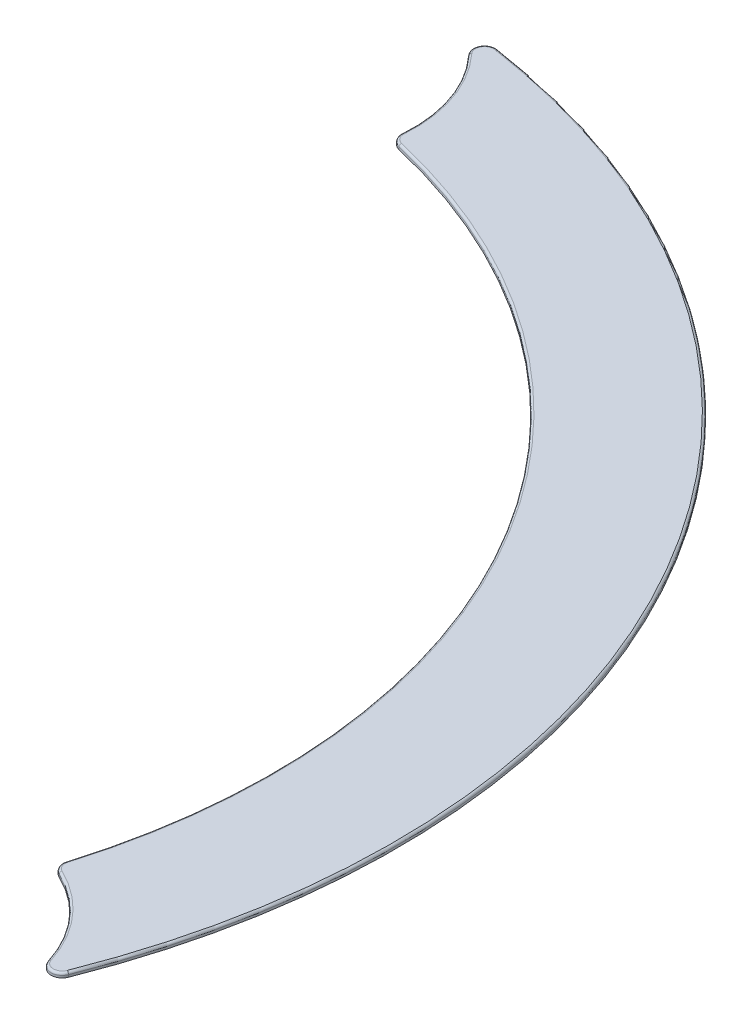
ISO-10303-21;
HEADER;
FILE_DESCRIPTION(('STEP AP214'),'2;1');
FILE_NAME('part.step','',(''),(''),'','','');
FILE_SCHEMA(('AUTOMOTIVE_DESIGN { 1 0 10303 214 1 1 1 1 }'));
ENDSEC;
DATA;
#1=APPLICATION_CONTEXT('core data for automotive mechanical design processes');
#2=APPLICATION_PROTOCOL_DEFINITION('international standard','automotive_design',2000,#1);
#3=PRODUCT_CONTEXT('',#1,'mechanical');
#4=PRODUCT('Part','Part','',(#3));
#5=PRODUCT_RELATED_PRODUCT_CATEGORY('part','',(#4));
#6=PRODUCT_DEFINITION_FORMATION('','',#4);
#7=PRODUCT_DEFINITION_CONTEXT('part definition',#1,'design');
#8=PRODUCT_DEFINITION('design','',#6,#7);
#9=PRODUCT_DEFINITION_SHAPE('','',#8);
#10=(LENGTH_UNIT() NAMED_UNIT(*) SI_UNIT(.MILLI.,.METRE.));
#11=(NAMED_UNIT(*) PLANE_ANGLE_UNIT() SI_UNIT($,.RADIAN.));
#12=(NAMED_UNIT(*) SI_UNIT($,.STERADIAN.) SOLID_ANGLE_UNIT());
#13=UNCERTAINTY_MEASURE_WITH_UNIT(LENGTH_MEASURE(1.E-05),#10,'distance_accuracy_value','');
#14=(GEOMETRIC_REPRESENTATION_CONTEXT(3) GLOBAL_UNCERTAINTY_ASSIGNED_CONTEXT((#13)) GLOBAL_UNIT_ASSIGNED_CONTEXT((#10,
#11,#12)) REPRESENTATION_CONTEXT('',''));
#15=CARTESIAN_POINT('',(0.,0.,0.));
#16=DIRECTION('',(0.,0.,1.));
#17=DIRECTION('',(1.,0.,0.));
#18=AXIS2_PLACEMENT_3D('',#15,#16,#17);
#19=CARTESIAN_POINT('',(0.,0.2,0.));
#20=DIRECTION('',(0.,-1.,0.));
#21=DIRECTION('',(0.,0.,-1.));
#22=AXIS2_PLACEMENT_3D('',#19,#20,#21);
#23=CYLINDRICAL_SURFACE('',#22,27.75);
#24=DIRECTION('',(0.,-1.,0.));
#25=VECTOR('',#24,1.);
#26=CARTESIAN_POINT('',(26.5742248571388,0.2,7.99206314053046));
#27=LINE('',#26,#25);
#28=CARTESIAN_POINT('',(26.5742248571388,0.,7.99206314053046));
#29=VERTEX_POINT('',#28);
#30=CARTESIAN_POINT('',(26.5742248571388,0.1,7.99206314053046));
#31=VERTEX_POINT('',#30);
#32=EDGE_CURVE('E161',#29,#31,#27,.F.);
#33=ORIENTED_EDGE('',*,*,#32,.T.);
#34=CARTESIAN_POINT('',(0.,0.1,0.));
#35=DIRECTION('',(0.,-1.,0.));
#36=DIRECTION('',(0.,0.,-1.));
#37=AXIS2_PLACEMENT_3D('',#34,#35,#36);
#38=CIRCLE('',#37,27.75);
#39=CARTESIAN_POINT('',(6.36578272022092,0.1,-27.0099853824273));
#40=VERTEX_POINT('',#39);
#41=EDGE_CURVE('E55',#31,#40,#38,.F.);
#42=ORIENTED_EDGE('',*,*,#41,.T.);
#43=DIRECTION('',(0.,-1.,0.));
#44=VECTOR('',#43,1.);
#45=CARTESIAN_POINT('',(6.36578272022092,0.2,-27.0099853824273));
#46=LINE('',#45,#44);
#47=CARTESIAN_POINT('',(6.36578272022092,0.,-27.0099853824273));
#48=VERTEX_POINT('',#47);
#49=EDGE_CURVE('E163',#40,#48,#46,.T.);
#50=ORIENTED_EDGE('',*,*,#49,.T.);
#51=CARTESIAN_POINT('',(0.,0.,0.));
#52=DIRECTION('',(0.,-1.,0.));
#53=DIRECTION('',(0.,0.,-1.));
#54=AXIS2_PLACEMENT_3D('',#51,#52,#53);
#55=CIRCLE('',#54,27.75);
#56=EDGE_CURVE('E220',#48,#29,#55,.T.);
#57=ORIENTED_EDGE('',*,*,#56,.T.);
#58=EDGE_LOOP('',(#33,#42,#50,#57));
#59=FACE_BOUND('',#58,.T.);
#60=ADVANCED_FACE('F31',(#59),#23,.F.);
#61=CARTESIAN_POINT('',(24.2487113059642,0.2,14.0000000000001));
#62=DIRECTION('',(0.,-1.,0.));
#63=DIRECTION('',(0.,0.,-1.));
#64=AXIS2_PLACEMENT_3D('',#61,#62,#63);
#65=CYLINDRICAL_SURFACE('',#64,6.);
#66=DIRECTION('',(0.,-1.,0.));
#67=VECTOR('',#66,1.);
#68=CARTESIAN_POINT('',(29.9736820208757,0.2,12.2042521576219));
#69=LINE('',#68,#67);
#70=CARTESIAN_POINT('',(29.9736820208757,0.,12.2042521576219));
#71=VERTEX_POINT('',#70);
#72=CARTESIAN_POINT('',(29.9736820208757,0.1,12.2042521576219));
#73=VERTEX_POINT('',#72);
#74=EDGE_CURVE('E165',#71,#73,#69,.F.);
#75=ORIENTED_EDGE('',*,*,#74,.T.);
#76=CARTESIAN_POINT('',(24.2487113059642,0.1,14.0000000000001));
#77=DIRECTION('',(0.,-1.,0.));
#78=DIRECTION('',(0.,0.,-1.));
#79=AXIS2_PLACEMENT_3D('',#76,#77,#78);
#80=CIRCLE('',#79,6.);
#81=CARTESIAN_POINT('',(26.837322149163,0.1,8.58713625679787));
#82=VERTEX_POINT('',#81);
#83=EDGE_CURVE('E193',#73,#82,#80,.F.);
#84=ORIENTED_EDGE('',*,*,#83,.T.);
#85=DIRECTION('',(0.,-1.,0.));
#86=VECTOR('',#85,1.);
#87=CARTESIAN_POINT('',(26.837322149163,0.2,8.58713625679787));
#88=LINE('',#87,#86);
#89=CARTESIAN_POINT('',(26.837322149163,0.,8.58713625679787));
#90=VERTEX_POINT('',#89);
#91=EDGE_CURVE('E168',#82,#90,#88,.T.);
#92=ORIENTED_EDGE('',*,*,#91,.T.);
#93=CARTESIAN_POINT('',(24.2487113059642,0.,14.0000000000001));
#94=DIRECTION('',(0.,-1.,0.));
#95=DIRECTION('',(0.,0.,1.));
#96=AXIS2_PLACEMENT_3D('',#93,#94,#95);
#97=CIRCLE('',#96,6.);
#98=EDGE_CURVE('E151',#90,#71,#97,.T.);
#99=ORIENTED_EDGE('',*,*,#98,.T.);
#100=EDGE_LOOP('',(#75,#84,#92,#99));
#101=FACE_BOUND('',#100,.T.);
#102=ADVANCED_FACE('F232',(#101),#65,.F.);
#103=CARTESIAN_POINT('',(0.,0.2,0.));
#104=DIRECTION('',(0.,-1.,0.));
#105=DIRECTION('',(0.,0.,-1.));
#106=AXIS2_PLACEMENT_3D('',#103,#104,#105);
#107=CYLINDRICAL_SURFACE('',#106,33.25);
#108=DIRECTION('',(0.,-1.,0.));
#109=VECTOR('',#108,1.);
#110=CARTESIAN_POINT('',(4.85885142671343,0.2,-32.8930701335878));
#111=LINE('',#110,#109);
#112=CARTESIAN_POINT('',(4.85885142671343,0.,-32.8930701335878));
#113=VERTEX_POINT('',#112);
#114=CARTESIAN_POINT('',(4.85885142671343,0.1,-32.8930701335878));
#115=VERTEX_POINT('',#114);
#116=EDGE_CURVE('E138',#113,#115,#111,.F.);
#117=ORIENTED_EDGE('',*,*,#116,.T.);
#118=CARTESIAN_POINT('',(0.,0.1,0.));
#119=DIRECTION('',(0.,-1.,0.));
#120=DIRECTION('',(0.,0.,-1.));
#121=AXIS2_PLACEMENT_3D('',#118,#119,#120);
#122=CIRCLE('',#121,33.25);
#123=CARTESIAN_POINT('',(30.9156600575069,0.1,12.2386462980459));
#124=VERTEX_POINT('',#123);
#125=EDGE_CURVE('E189',#115,#124,#122,.T.);
#126=ORIENTED_EDGE('',*,*,#125,.T.);
#127=DIRECTION('',(0.,-1.,0.));
#128=VECTOR('',#127,1.);
#129=CARTESIAN_POINT('',(30.9156600575069,0.2,12.2386462980459));
#130=LINE('',#129,#128);
#131=CARTESIAN_POINT('',(30.9156600575069,0.,12.2386462980459));
#132=VERTEX_POINT('',#131);
#133=EDGE_CURVE('E142',#124,#132,#130,.T.);
#134=ORIENTED_EDGE('',*,*,#133,.T.);
#135=CARTESIAN_POINT('',(0.,0.,0.));
#136=DIRECTION('',(0.,1.,0.));
#137=DIRECTION('',(0.,0.,1.));
#138=AXIS2_PLACEMENT_3D('',#135,#136,#137);
#139=CIRCLE('',#138,33.25);
#140=EDGE_CURVE('E148',#132,#113,#139,.T.);
#141=ORIENTED_EDGE('',*,*,#140,.T.);
#142=EDGE_LOOP('',(#117,#126,#134,#141));
#143=FACE_BOUND('',#142,.T.);
#144=ADVANCED_FACE('F272',(#143),#107,.T.);
#145=CARTESIAN_POINT('',(0.,0.2,-28.));
#146=DIRECTION('',(0.,-1.,0.));
#147=DIRECTION('',(0.,0.,-1.));
#148=AXIS2_PLACEMENT_3D('',#145,#146,#147);
#149=CYLINDRICAL_SURFACE('',#148,6.);
#150=DIRECTION('',(0.,-1.,0.));
#151=VECTOR('',#150,1.);
#152=CARTESIAN_POINT('',(5.98198293043628,0.2,-27.5353708791209));
#153=LINE('',#152,#151);
#154=CARTESIAN_POINT('',(5.98198293043628,0.,-27.5353708791209));
#155=VERTEX_POINT('',#154);
#156=CARTESIAN_POINT('',(5.98198293043628,0.1,-27.5353708791209));
#157=VERTEX_POINT('',#156);
#158=EDGE_CURVE('E132',#155,#157,#153,.F.);
#159=ORIENTED_EDGE('',*,*,#158,.T.);
#160=CARTESIAN_POINT('',(0.,0.1,-28.));
#161=DIRECTION('',(0.,-1.,0.));
#162=DIRECTION('',(0.,0.,-1.));
#163=AXIS2_PLACEMENT_3D('',#160,#161,#162);
#164=CIRCLE('',#163,6.);
#165=CARTESIAN_POINT('',(4.41764860774639,0.1,-32.0600961538462));
#166=VERTEX_POINT('',#165);
#167=EDGE_CURVE('E11',#157,#166,#164,.F.);
#168=ORIENTED_EDGE('',*,*,#167,.T.);
#169=DIRECTION('',(0.,-1.,0.));
#170=VECTOR('',#169,1.);
#171=CARTESIAN_POINT('',(4.41764860774639,0.2,-32.0600961538462));
#172=LINE('',#171,#170);
#173=CARTESIAN_POINT('',(4.41764860774639,0.,-32.0600961538462));
#174=VERTEX_POINT('',#173);
#175=EDGE_CURVE('E122',#166,#174,#172,.T.);
#176=ORIENTED_EDGE('',*,*,#175,.T.);
#177=CARTESIAN_POINT('',(0.,0.,-28.));
#178=DIRECTION('',(0.,-1.,0.));
#179=DIRECTION('',(0.,0.,1.));
#180=AXIS2_PLACEMENT_3D('',#177,#178,#179);
#181=CIRCLE('',#180,6.);
#182=EDGE_CURVE('E126',#174,#155,#181,.T.);
#183=ORIENTED_EDGE('',*,*,#182,.T.);
#184=EDGE_LOOP('',(#159,#168,#176,#183));
#185=FACE_BOUND('',#184,.T.);
#186=ADVANCED_FACE('F124',(#185),#149,.F.);
#187=CARTESIAN_POINT('',(12.1243556529821,0.2,7.00000000000006));
#188=DIRECTION('',(0.,-1.,0.));
#189=DIRECTION('',(0.,0.,-1.));
#190=AXIS2_PLACEMENT_3D('',#187,#188,#189);
#191=PLANE('',#190);
#192=CARTESIAN_POINT('',(0.,0.2,0.));
#193=DIRECTION('',(0.,-1.,0.));
#194=DIRECTION('',(0.,0.,-1.));
#195=AXIS2_PLACEMENT_3D('',#192,#193,#194);
#196=CIRCLE('',#195,33.15);
#197=CARTESIAN_POINT('',(30.8226806287625,0.2,12.2018383392548));
#198=VERTEX_POINT('',#197);
#199=CARTESIAN_POINT('',(4.84423833971579,0.2,-32.7941436068702));
#200=VERTEX_POINT('',#199);
#201=EDGE_CURVE('E182',#198,#200,#196,.F.);
#202=ORIENTED_EDGE('',*,*,#201,.T.);
#203=CARTESIAN_POINT('',(4.78578599172526,0.2,-32.3984375));
#204=DIRECTION('',(0.,-1.,0.));
#205=DIRECTION('',(0.,0.,-1.));
#206=AXIS2_PLACEMENT_3D('',#203,#204,#205);
#207=CIRCLE('',#206,0.4);
#208=CARTESIAN_POINT('',(4.49127608454216,0.2,-32.1277644230769));
#209=VERTEX_POINT('',#208);
#210=EDGE_CURVE('E184',#200,#209,#207,.F.);
#211=ORIENTED_EDGE('',*,*,#210,.T.);
#212=CARTESIAN_POINT('',(0.,0.2,-28.));
#213=DIRECTION('',(0.,-1.,0.));
#214=DIRECTION('',(0.,0.,-1.));
#215=AXIS2_PLACEMENT_3D('',#212,#213,#214);
#216=CIRCLE('',#215,6.1);
#217=CARTESIAN_POINT('',(6.08168264594355,0.2,-27.5276270604396));
#218=VERTEX_POINT('',#217);
#219=EDGE_CURVE('E170',#209,#218,#216,.T.);
#220=ORIENTED_EDGE('',*,*,#219,.T.);
#221=CARTESIAN_POINT('',(6.48048150797265,0.2,-27.4966517857143));
#222=DIRECTION('',(0.,-1.,0.));
#223=DIRECTION('',(0.,0.,-1.));
#224=AXIS2_PLACEMENT_3D('',#221,#222,#223);
#225=CIRCLE('',#224,0.4);
#226=CARTESIAN_POINT('',(6.38872247777127,0.2,-27.1073186630847));
#227=VERTEX_POINT('',#226);
#228=EDGE_CURVE('E172',#218,#227,#225,.F.);
#229=ORIENTED_EDGE('',*,*,#228,.T.);
#230=CARTESIAN_POINT('',(0.,0.2,0.));
#231=DIRECTION('',(0.,-1.,0.));
#232=DIRECTION('',(0.,0.,-1.));
#233=AXIS2_PLACEMENT_3D('',#230,#231,#232);
#234=CIRCLE('',#233,27.85);
#235=CARTESIAN_POINT('',(26.669987829597,0.2,8.0208633680639));
#236=VERTEX_POINT('',#235);
#237=EDGE_CURVE('E174',#227,#236,#234,.T.);
#238=ORIENTED_EDGE('',*,*,#237,.T.);
#239=CARTESIAN_POINT('',(27.0530397194296,0.2,8.13606427819768));
#240=DIRECTION('',(0.,-1.,0.));
#241=DIRECTION('',(0.,0.,-1.));
#242=AXIS2_PLACEMENT_3D('',#239,#240,#241);
#243=CIRCLE('',#242,0.4);
#244=CARTESIAN_POINT('',(26.8804656632164,0.2,8.49692186107783));
#245=VERTEX_POINT('',#244);
#246=EDGE_CURVE('E176',#236,#245,#243,.F.);
#247=ORIENTED_EDGE('',*,*,#246,.T.);
#248=CARTESIAN_POINT('',(24.2487113059642,0.2,14.0000000000001));
#249=DIRECTION('',(0.,-1.,0.));
#250=DIRECTION('',(0.,0.,-1.));
#251=AXIS2_PLACEMENT_3D('',#248,#249,#250);
#252=CIRCLE('',#251,6.1);
#253=CARTESIAN_POINT('',(30.0690981994575,0.2,12.1743230269156));
#254=VERTEX_POINT('',#253);
#255=EDGE_CURVE('E178',#245,#254,#252,.T.);
#256=ORIENTED_EDGE('',*,*,#255,.T.);
#257=CARTESIAN_POINT('',(30.450762913785,0.2,12.0546065040904));
#258=DIRECTION('',(0.,-1.,0.));
#259=DIRECTION('',(0.,0.,-1.));
#260=AXIS2_PLACEMENT_3D('',#257,#258,#259);
#261=CIRCLE('',#260,0.4);
#262=EDGE_CURVE('E180',#254,#198,#261,.F.);
#263=ORIENTED_EDGE('',*,*,#262,.T.);
#264=EDGE_LOOP('',(#202,#211,#220,#229,#238,#247,#256,#263));
#265=FACE_BOUND('',#264,.T.);
#266=ADVANCED_FACE('F252',(#265),#191,.F.);
#267=CARTESIAN_POINT('',(12.1243556529821,0.,7.00000000000006));
#268=DIRECTION('',(0.,-1.,0.));
#269=DIRECTION('',(0.,0.,-1.));
#270=AXIS2_PLACEMENT_3D('',#267,#268,#269);
#271=PLANE('',#270);
#272=ORIENTED_EDGE('',*,*,#182,.F.);
#273=CARTESIAN_POINT('',(4.78578599172526,0.,-32.3984375));
#274=DIRECTION('',(0.,-1.,0.));
#275=DIRECTION('',(0.,0.,-1.));
#276=AXIS2_PLACEMENT_3D('',#273,#274,#275);
#277=CIRCLE('',#276,0.5);
#278=EDGE_CURVE('E135',#174,#113,#277,.T.);
#279=ORIENTED_EDGE('',*,*,#278,.T.);
#280=ORIENTED_EDGE('',*,*,#140,.F.);
#281=CARTESIAN_POINT('',(30.450762913785,0.,12.0546065040904));
#282=DIRECTION('',(0.,-1.,0.));
#283=DIRECTION('',(0.,0.,-1.));
#284=AXIS2_PLACEMENT_3D('',#281,#282,#283);
#285=CIRCLE('',#284,0.5);
#286=EDGE_CURVE('E131',#132,#71,#285,.T.);
#287=ORIENTED_EDGE('',*,*,#286,.T.);
#288=ORIENTED_EDGE('',*,*,#98,.F.);
#289=CARTESIAN_POINT('',(27.0530397194296,0.,8.13606427819768));
#290=DIRECTION('',(0.,-1.,0.));
#291=DIRECTION('',(0.,0.,-1.));
#292=AXIS2_PLACEMENT_3D('',#289,#290,#291);
#293=CIRCLE('',#292,0.5);
#294=EDGE_CURVE('E156',#90,#29,#293,.T.);
#295=ORIENTED_EDGE('',*,*,#294,.T.);
#296=ORIENTED_EDGE('',*,*,#56,.F.);
#297=CARTESIAN_POINT('',(6.48048150797265,0.,-27.4966517857143));
#298=DIRECTION('',(0.,-1.,0.));
#299=DIRECTION('',(0.,0.,-1.));
#300=AXIS2_PLACEMENT_3D('',#297,#298,#299);
#301=CIRCLE('',#300,0.5);
#302=EDGE_CURVE('E143',#48,#155,#301,.T.);
#303=ORIENTED_EDGE('',*,*,#302,.T.);
#304=EDGE_LOOP('',(#272,#279,#280,#287,#288,#295,#296,#303));
#305=FACE_BOUND('',#304,.T.);
#306=ADVANCED_FACE('F145',(#305),#271,.T.);
#307=CARTESIAN_POINT('',(4.78578599172526,0.2,-32.3984375));
#308=DIRECTION('',(0.,1.,0.));
#309=DIRECTION('',(0.,0.,1.));
#310=AXIS2_PLACEMENT_3D('',#307,#308,#309);
#311=CYLINDRICAL_SURFACE('',#310,0.5);
#312=ORIENTED_EDGE('',*,*,#175,.F.);
#313=CARTESIAN_POINT('',(4.78578599172526,0.1,-32.3984375));
#314=DIRECTION('',(0.,-1.,0.));
#315=DIRECTION('',(0.,0.,-1.));
#316=AXIS2_PLACEMENT_3D('',#313,#314,#315);
#317=CIRCLE('',#316,0.5);
#318=EDGE_CURVE('E187',#166,#115,#317,.T.);
#319=ORIENTED_EDGE('',*,*,#318,.T.);
#320=ORIENTED_EDGE('',*,*,#116,.F.);
#321=ORIENTED_EDGE('',*,*,#278,.F.);
#322=EDGE_LOOP('',(#312,#319,#320,#321));
#323=FACE_BOUND('',#322,.T.);
#324=ADVANCED_FACE('F136',(#323),#311,.T.);
#325=CARTESIAN_POINT('',(6.48048150797265,0.2,-27.4966517857143));
#326=DIRECTION('',(0.,-1.,0.));
#327=DIRECTION('',(0.,0.,-1.));
#328=AXIS2_PLACEMENT_3D('',#325,#326,#327);
#329=CYLINDRICAL_SURFACE('',#328,0.5);
#330=ORIENTED_EDGE('',*,*,#49,.F.);
#331=CARTESIAN_POINT('',(6.48048150797265,0.1,-27.4966517857143));
#332=DIRECTION('',(0.,-1.,0.));
#333=DIRECTION('',(0.,0.,-1.));
#334=AXIS2_PLACEMENT_3D('',#331,#332,#333);
#335=CIRCLE('',#334,0.5);
#336=EDGE_CURVE('E40',#40,#157,#335,.T.);
#337=ORIENTED_EDGE('',*,*,#336,.T.);
#338=ORIENTED_EDGE('',*,*,#158,.F.);
#339=ORIENTED_EDGE('',*,*,#302,.F.);
#340=EDGE_LOOP('',(#330,#337,#338,#339));
#341=FACE_BOUND('',#340,.T.);
#342=ADVANCED_FACE('F288',(#341),#329,.T.);
#343=CARTESIAN_POINT('',(27.0530397194296,0.2,8.13606427819768));
#344=DIRECTION('',(0.,-1.,0.));
#345=DIRECTION('',(0.,0.,-1.));
#346=AXIS2_PLACEMENT_3D('',#343,#344,#345);
#347=CYLINDRICAL_SURFACE('',#346,0.5);
#348=ORIENTED_EDGE('',*,*,#91,.F.);
#349=CARTESIAN_POINT('',(27.0530397194296,0.1,8.13606427819768));
#350=DIRECTION('',(0.,-1.,0.));
#351=DIRECTION('',(0.,0.,-1.));
#352=AXIS2_PLACEMENT_3D('',#349,#350,#351);
#353=CIRCLE('',#352,0.5);
#354=EDGE_CURVE('E195',#82,#31,#353,.T.);
#355=ORIENTED_EDGE('',*,*,#354,.T.);
#356=ORIENTED_EDGE('',*,*,#32,.F.);
#357=ORIENTED_EDGE('',*,*,#294,.F.);
#358=EDGE_LOOP('',(#348,#355,#356,#357));
#359=FACE_BOUND('',#358,.T.);
#360=ADVANCED_FACE('F257',(#359),#347,.T.);
#361=CARTESIAN_POINT('',(30.450762913785,0.2,12.0546065040904));
#362=DIRECTION('',(0.,1.,0.));
#363=DIRECTION('',(0.,0.,1.));
#364=AXIS2_PLACEMENT_3D('',#361,#362,#363);
#365=CYLINDRICAL_SURFACE('',#364,0.5);
#366=ORIENTED_EDGE('',*,*,#133,.F.);
#367=CARTESIAN_POINT('',(30.450762913785,0.1,12.0546065040904));
#368=DIRECTION('',(0.,-1.,0.));
#369=DIRECTION('',(0.,0.,-1.));
#370=AXIS2_PLACEMENT_3D('',#367,#368,#369);
#371=CIRCLE('',#370,0.5);
#372=EDGE_CURVE('E191',#124,#73,#371,.T.);
#373=ORIENTED_EDGE('',*,*,#372,.T.);
#374=ORIENTED_EDGE('',*,*,#74,.F.);
#375=ORIENTED_EDGE('',*,*,#286,.F.);
#376=EDGE_LOOP('',(#366,#373,#374,#375));
#377=FACE_BOUND('',#376,.T.);
#378=ADVANCED_FACE('F238',(#377),#365,.T.);
#379=CARTESIAN_POINT('',(27.0530397194296,0.1,8.13606427819768));
#380=DIRECTION('',(0.,-1.,0.));
#381=DIRECTION('',(0.,0.,-1.));
#382=AXIS2_PLACEMENT_3D('',#379,#380,#381);
#383=TOROIDAL_SURFACE('',#382,0.4,0.1);
#384=CARTESIAN_POINT('',(26.669987829597,0.1,8.0208633680639));
#385=DIRECTION('',(0.288002275334424,0.,-0.957629724581581));
#386=DIRECTION('',(-0.957629724581581,0.,-0.288002275334424));
#387=AXIS2_PLACEMENT_3D('',#384,#385,#386);
#388=CIRCLE('',#387,0.1);
#389=EDGE_CURVE('E214',#31,#236,#388,.T.);
#390=ORIENTED_EDGE('',*,*,#389,.F.);
#391=ORIENTED_EDGE('',*,*,#354,.F.);
#392=CARTESIAN_POINT('',(26.8804656632164,0.1,8.49692186107783));
#393=DIRECTION('',(0.90214395720038,0.,0.431435140533127));
#394=DIRECTION('',(0.431435140533127,0.,-0.90214395720038));
#395=AXIS2_PLACEMENT_3D('',#392,#393,#394);
#396=CIRCLE('',#395,0.1);
#397=EDGE_CURVE('E35',#245,#82,#396,.T.);
#398=ORIENTED_EDGE('',*,*,#397,.F.);
#399=ORIENTED_EDGE('',*,*,#246,.F.);
#400=EDGE_LOOP('',(#390,#391,#398,#399));
#401=FACE_BOUND('',#400,.T.);
#402=ADVANCED_FACE('F33',(#401),#383,.T.);
#403=CARTESIAN_POINT('',(24.2487113059642,0.1,14.0000000000001));
#404=DIRECTION('',(0.,-1.,0.));
#405=DIRECTION('',(0.,0.,-1.));
#406=AXIS2_PLACEMENT_3D('',#403,#404,#405);
#407=TOROIDAL_SURFACE('',#406,6.1,0.1);
#408=ORIENTED_EDGE('',*,*,#397,.T.);
#409=ORIENTED_EDGE('',*,*,#83,.F.);
#410=CARTESIAN_POINT('',(30.0690981994575,0.1,12.1743230269156));
#411=DIRECTION('',(0.299291307063056,0.,0.954161785818573));
#412=DIRECTION('',(0.954161785818573,0.,-0.299291307063056));
#413=AXIS2_PLACEMENT_3D('',#410,#411,#412);
#414=CIRCLE('',#413,0.1);
#415=EDGE_CURVE('E212',#254,#73,#414,.T.);
#416=ORIENTED_EDGE('',*,*,#415,.F.);
#417=ORIENTED_EDGE('',*,*,#255,.F.);
#418=EDGE_LOOP('',(#408,#409,#416,#417));
#419=FACE_BOUND('',#418,.T.);
#420=ADVANCED_FACE('F254',(#419),#407,.T.);
#421=CARTESIAN_POINT('',(0.,0.1,0.));
#422=DIRECTION('',(0.,-1.,0.));
#423=DIRECTION('',(0.,0.,-1.));
#424=AXIS2_PLACEMENT_3D('',#421,#422,#423);
#425=TOROIDAL_SURFACE('',#424,27.85,0.1);
#426=ORIENTED_EDGE('',*,*,#389,.T.);
#427=ORIENTED_EDGE('',*,*,#237,.F.);
#428=CARTESIAN_POINT('',(6.38872247777127,0.1,-27.1073186630847));
#429=DIRECTION('',(-0.973332806573956,0.,-0.22939757550346));
#430=DIRECTION('',(-0.22939757550346,0.,0.973332806573956));
#431=AXIS2_PLACEMENT_3D('',#428,#429,#430);
#432=CIRCLE('',#431,0.1);
#433=EDGE_CURVE('E209',#40,#227,#432,.T.);
#434=ORIENTED_EDGE('',*,*,#433,.F.);
#435=ORIENTED_EDGE('',*,*,#41,.F.);
#436=EDGE_LOOP('',(#426,#427,#434,#435));
#437=FACE_BOUND('',#436,.T.);
#438=ADVANCED_FACE('F260',(#437),#425,.T.);
#439=CARTESIAN_POINT('',(30.450762913785,0.1,12.0546065040904));
#440=DIRECTION('',(0.,-1.,0.));
#441=DIRECTION('',(0.,0.,-1.));
#442=AXIS2_PLACEMENT_3D('',#439,#440,#441);
#443=TOROIDAL_SURFACE('',#442,0.4,0.1);
#444=ORIENTED_EDGE('',*,*,#415,.T.);
#445=ORIENTED_EDGE('',*,*,#372,.F.);
#446=CARTESIAN_POINT('',(30.8226806287625,0.1,12.2018383392548));
#447=DIRECTION('',(0.36807958791115,0.,-0.929794287443818));
#448=DIRECTION('',(-0.929794287443818,0.,-0.36807958791115));
#449=AXIS2_PLACEMENT_3D('',#446,#447,#448);
#450=CIRCLE('',#449,0.1);
#451=EDGE_CURVE('E206',#198,#124,#450,.T.);
#452=ORIENTED_EDGE('',*,*,#451,.F.);
#453=ORIENTED_EDGE('',*,*,#262,.F.);
#454=EDGE_LOOP('',(#444,#445,#452,#453));
#455=FACE_BOUND('',#454,.T.);
#456=ADVANCED_FACE('F242',(#455),#443,.T.);
#457=CARTESIAN_POINT('',(6.48048150797265,0.1,-27.4966517857143));
#458=DIRECTION('',(0.,-1.,0.));
#459=DIRECTION('',(0.,0.,-1.));
#460=AXIS2_PLACEMENT_3D('',#457,#458,#459);
#461=TOROIDAL_SURFACE('',#460,0.4,0.1);
#462=ORIENTED_EDGE('',*,*,#433,.T.);
#463=ORIENTED_EDGE('',*,*,#228,.F.);
#464=CARTESIAN_POINT('',(6.08168264594356,0.1,-27.5276270604396));
#465=DIRECTION('',(0.0774381868131821,0.,-0.996997155072715));
#466=DIRECTION('',(-0.996997155072715,0.,-0.0774381868131821));
#467=AXIS2_PLACEMENT_3D('',#464,#465,#466);
#468=CIRCLE('',#467,0.1);
#469=EDGE_CURVE('E203',#157,#218,#468,.T.);
#470=ORIENTED_EDGE('',*,*,#469,.F.);
#471=ORIENTED_EDGE('',*,*,#336,.F.);
#472=EDGE_LOOP('',(#462,#463,#470,#471));
#473=FACE_BOUND('',#472,.T.);
#474=ADVANCED_FACE('F264',(#473),#461,.T.);
#475=CARTESIAN_POINT('',(0.,0.1,0.));
#476=DIRECTION('',(0.,-1.,0.));
#477=DIRECTION('',(0.,0.,-1.));
#478=AXIS2_PLACEMENT_3D('',#475,#476,#477);
#479=TOROIDAL_SURFACE('',#478,33.15,0.1);
#480=ORIENTED_EDGE('',*,*,#451,.T.);
#481=ORIENTED_EDGE('',*,*,#125,.F.);
#482=CARTESIAN_POINT('',(4.84423833971579,0.1,-32.7941436068702));
#483=DIRECTION('',(-0.989265267175572,0.,-0.146130869976347));
#484=DIRECTION('',(-0.146130869976347,0.,0.989265267175572));
#485=AXIS2_PLACEMENT_3D('',#482,#483,#484);
#486=CIRCLE('',#485,0.1);
#487=EDGE_CURVE('E201',#200,#115,#486,.T.);
#488=ORIENTED_EDGE('',*,*,#487,.F.);
#489=ORIENTED_EDGE('',*,*,#201,.F.);
#490=EDGE_LOOP('',(#480,#481,#488,#489));
#491=FACE_BOUND('',#490,.T.);
#492=ADVANCED_FACE('F248',(#491),#479,.T.);
#493=CARTESIAN_POINT('',(0.,0.1,-28.));
#494=DIRECTION('',(0.,-1.,0.));
#495=DIRECTION('',(0.,0.,-1.));
#496=AXIS2_PLACEMENT_3D('',#493,#494,#495);
#497=TOROIDAL_SURFACE('',#496,6.1,0.1);
#498=ORIENTED_EDGE('',*,*,#469,.T.);
#499=ORIENTED_EDGE('',*,*,#219,.F.);
#500=CARTESIAN_POINT('',(4.49127608454216,0.1,-32.1277644230769));
#501=DIRECTION('',(-0.676682692307692,0.,-0.736274767957733));
#502=DIRECTION('',(-0.736274767957733,0.,0.676682692307692));
#503=AXIS2_PLACEMENT_3D('',#500,#501,#502);
#504=CIRCLE('',#503,0.1);
#505=EDGE_CURVE('E199',#166,#209,#504,.T.);
#506=ORIENTED_EDGE('',*,*,#505,.F.);
#507=ORIENTED_EDGE('',*,*,#167,.F.);
#508=EDGE_LOOP('',(#498,#499,#506,#507));
#509=FACE_BOUND('',#508,.T.);
#510=ADVANCED_FACE('F268',(#509),#497,.T.);
#511=CARTESIAN_POINT('',(4.78578599172526,0.1,-32.3984375));
#512=DIRECTION('',(0.,-1.,0.));
#513=DIRECTION('',(0.,0.,-1.));
#514=AXIS2_PLACEMENT_3D('',#511,#512,#513);
#515=TOROIDAL_SURFACE('',#514,0.4,0.1);
#516=ORIENTED_EDGE('',*,*,#487,.T.);
#517=ORIENTED_EDGE('',*,*,#318,.F.);
#518=ORIENTED_EDGE('',*,*,#505,.T.);
#519=ORIENTED_EDGE('',*,*,#210,.F.);
#520=EDGE_LOOP('',(#516,#517,#518,#519));
#521=FACE_BOUND('',#520,.T.);
#522=ADVANCED_FACE('F270',(#521),#515,.T.);
#523=CLOSED_SHELL('',(#60,#102,#144,#186,#266,#306,#324,#342,#360,#378,#402,#420,#438,#456,#474,
#492,#510,#522));
#524=MANIFOLD_SOLID_BREP('B2',#523);
#525=ADVANCED_BREP_SHAPE_REPRESENTATION('',(#18,#524),#14);
#526=SHAPE_DEFINITION_REPRESENTATION(#9,#525);
ENDSEC;
END-ISO-10303-21;
